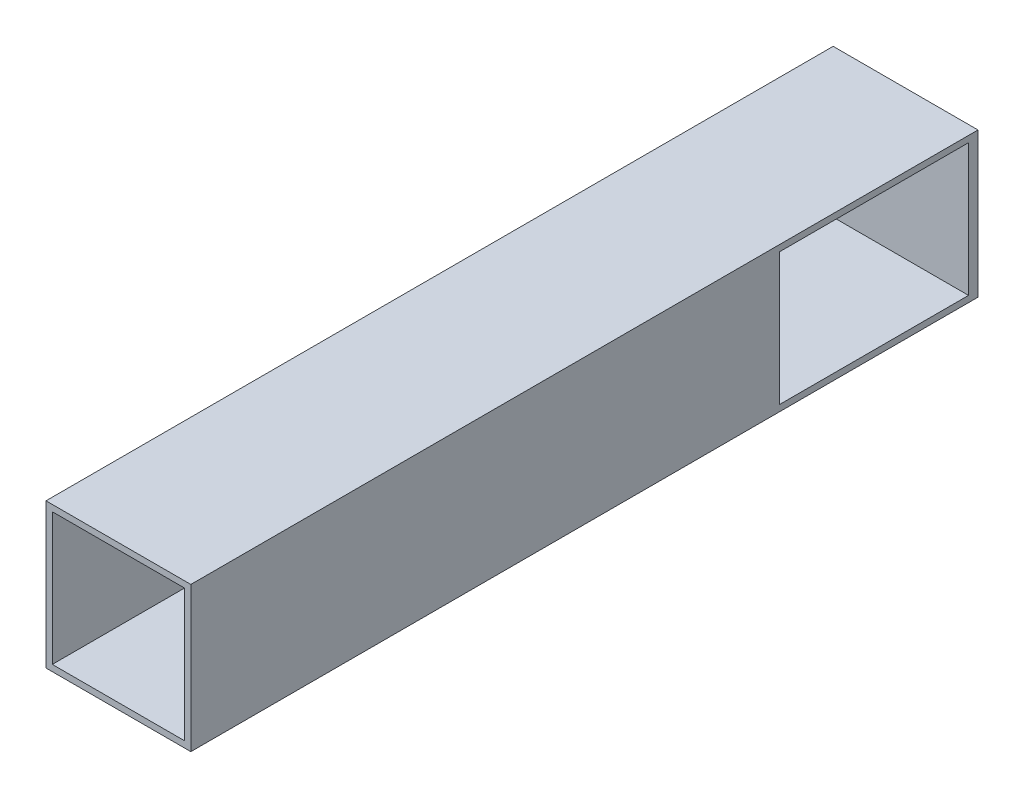
ISO-10303-21;
HEADER;
FILE_DESCRIPTION(('STEP AP214'),'2;1');
FILE_NAME('part.step','',(''),(''),'','','');
FILE_SCHEMA(('AUTOMOTIVE_DESIGN { 1 0 10303 214 1 1 1 1 }'));
ENDSEC;
DATA;
#1=APPLICATION_CONTEXT('core data for automotive mechanical design processes');
#2=APPLICATION_PROTOCOL_DEFINITION('international standard','automotive_design',2000,#1);
#3=PRODUCT_CONTEXT('',#1,'mechanical');
#4=PRODUCT('Part','Part','',(#3));
#5=PRODUCT_RELATED_PRODUCT_CATEGORY('part','',(#4));
#6=PRODUCT_DEFINITION_FORMATION('','',#4);
#7=PRODUCT_DEFINITION_CONTEXT('part definition',#1,'design');
#8=PRODUCT_DEFINITION('design','',#6,#7);
#9=PRODUCT_DEFINITION_SHAPE('','',#8);
#10=(LENGTH_UNIT() NAMED_UNIT(*) SI_UNIT(.MILLI.,.METRE.));
#11=(NAMED_UNIT(*) PLANE_ANGLE_UNIT() SI_UNIT($,.RADIAN.));
#12=(NAMED_UNIT(*) SI_UNIT($,.STERADIAN.) SOLID_ANGLE_UNIT());
#13=UNCERTAINTY_MEASURE_WITH_UNIT(LENGTH_MEASURE(1.E-05),#10,'distance_accuracy_value','');
#14=(GEOMETRIC_REPRESENTATION_CONTEXT(3) GLOBAL_UNCERTAINTY_ASSIGNED_CONTEXT((#13)) GLOBAL_UNIT_ASSIGNED_CONTEXT((#10,
#11,#12)) REPRESENTATION_CONTEXT('',''));
#15=CARTESIAN_POINT('',(0.,0.,0.));
#16=DIRECTION('',(0.,0.,1.));
#17=DIRECTION('',(1.,0.,0.));
#18=AXIS2_PLACEMENT_3D('',#15,#16,#17);
#19=CARTESIAN_POINT('',(13.6309958016777,15.2898102048579,635.));
#20=DIRECTION('',(1.,0.,0.));
#21=DIRECTION('',(0.,0.,-1.));
#22=AXIS2_PLACEMENT_3D('',#19,#20,#21);
#23=PLANE('',#22);
#24=DIRECTION('',(0.,-1.,0.));
#25=VECTOR('',#24,1.);
#26=CARTESIAN_POINT('',(13.6309958016777,15.2898102048579,0.));
#27=LINE('',#26,#25);
#28=CARTESIAN_POINT('',(13.6309958016777,15.2898102048579,0.));
#29=VERTEX_POINT('',#28);
#30=CARTESIAN_POINT('',(13.6309958016777,-101.550189795142,0.));
#31=VERTEX_POINT('',#30);
#32=EDGE_CURVE('E162',#29,#31,#27,.T.);
#33=ORIENTED_EDGE('',*,*,#32,.T.);
#34=DIRECTION('',(0.,0.,-1.));
#35=VECTOR('',#34,1.);
#36=CARTESIAN_POINT('',(13.6309958016777,-101.550189795142,635.));
#37=LINE('',#36,#35);
#38=CARTESIAN_POINT('',(13.6309958016777,-101.550189795142,635.));
#39=VERTEX_POINT('',#38);
#40=EDGE_CURVE('E11',#39,#31,#37,.T.);
#41=ORIENTED_EDGE('',*,*,#40,.F.);
#42=DIRECTION('',(0.,-1.,0.));
#43=VECTOR('',#42,1.);
#44=CARTESIAN_POINT('',(13.6309958016777,15.2898102048579,635.));
#45=LINE('',#44,#43);
#46=CARTESIAN_POINT('',(13.6309958016777,15.2898102048579,635.));
#47=VERTEX_POINT('',#46);
#48=EDGE_CURVE('E169',#47,#39,#45,.T.);
#49=ORIENTED_EDGE('',*,*,#48,.F.);
#50=DIRECTION('',(0.,0.,-1.));
#51=VECTOR('',#50,1.);
#52=CARTESIAN_POINT('',(13.6309958016777,15.2898102048579,635.));
#53=LINE('',#52,#51);
#54=EDGE_CURVE('E179',#47,#29,#53,.T.);
#55=ORIENTED_EDGE('',*,*,#54,.T.);
#56=EDGE_LOOP('',(#33,#41,#49,#55));
#57=FACE_BOUND('',#56,.T.);
#58=ADVANCED_FACE('F42',(#57),#23,.F.);
#59=CARTESIAN_POINT('',(13.6309958016777,-101.550189795142,635.));
#60=DIRECTION('',(0.,1.,0.));
#61=DIRECTION('',(-1.,0.,0.));
#62=AXIS2_PLACEMENT_3D('',#59,#60,#61);
#63=PLANE('',#62);
#64=DIRECTION('',(1.,0.,0.));
#65=VECTOR('',#64,1.);
#66=CARTESIAN_POINT('',(13.6309958016777,-101.550189795142,0.));
#67=LINE('',#66,#65);
#68=CARTESIAN_POINT('',(130.470995801678,-101.550189795142,0.));
#69=VERTEX_POINT('',#68);
#70=EDGE_CURVE('E182',#31,#69,#67,.T.);
#71=ORIENTED_EDGE('',*,*,#70,.T.);
#72=DIRECTION('',(0.,0.,-1.));
#73=VECTOR('',#72,1.);
#74=CARTESIAN_POINT('',(130.470995801678,-101.550189795142,635.));
#75=LINE('',#74,#73);
#76=CARTESIAN_POINT('',(130.470995801678,-101.550189795142,635.));
#77=VERTEX_POINT('',#76);
#78=EDGE_CURVE('E49',#77,#69,#75,.T.);
#79=ORIENTED_EDGE('',*,*,#78,.F.);
#80=DIRECTION('',(1.,0.,0.));
#81=VECTOR('',#80,1.);
#82=CARTESIAN_POINT('',(13.6309958016777,-101.550189795142,635.));
#83=LINE('',#82,#81);
#84=EDGE_CURVE('E172',#39,#77,#83,.T.);
#85=ORIENTED_EDGE('',*,*,#84,.F.);
#86=ORIENTED_EDGE('',*,*,#40,.T.);
#87=EDGE_LOOP('',(#71,#79,#85,#86));
#88=FACE_BOUND('',#87,.T.);
#89=ADVANCED_FACE('F210',(#88),#63,.F.);
#90=CARTESIAN_POINT('',(130.470995801678,15.2898102048579,635.));
#91=DIRECTION('',(-1.,0.,0.));
#92=DIRECTION('',(0.,0.,1.));
#93=AXIS2_PLACEMENT_3D('',#90,#91,#92);
#94=PLANE('',#93);
#95=DIRECTION('',(0.,0.,1.));
#96=VECTOR('',#95,1.);
#97=CARTESIAN_POINT('',(130.470995801678,10.2098102048579,160.02));
#98=LINE('',#97,#96);
#99=CARTESIAN_POINT('',(130.470995801678,10.2098102048579,7.62000000000007));
#100=VERTEX_POINT('',#99);
#101=CARTESIAN_POINT('',(130.470995801678,10.2098102048579,160.02));
#102=VERTEX_POINT('',#101);
#103=EDGE_CURVE('E127',#100,#102,#98,.T.);
#104=ORIENTED_EDGE('',*,*,#103,.F.);
#105=DIRECTION('',(0.,1.,0.));
#106=VECTOR('',#105,1.);
#107=CARTESIAN_POINT('',(130.470995801678,-96.4701897951421,7.62));
#108=LINE('',#107,#106);
#109=CARTESIAN_POINT('',(130.470995801678,-96.4701897951421,7.62));
#110=VERTEX_POINT('',#109);
#111=EDGE_CURVE('E131',#110,#100,#108,.T.);
#112=ORIENTED_EDGE('',*,*,#111,.F.);
#113=DIRECTION('',(0.,0.,-1.));
#114=VECTOR('',#113,1.);
#115=CARTESIAN_POINT('',(130.470995801678,-96.4701897951421,7.62));
#116=LINE('',#115,#114);
#117=CARTESIAN_POINT('',(130.470995801678,-96.4701897951421,160.02));
#118=VERTEX_POINT('',#117);
#119=EDGE_CURVE('E124',#118,#110,#116,.T.);
#120=ORIENTED_EDGE('',*,*,#119,.F.);
#121=DIRECTION('',(0.,-1.,0.));
#122=VECTOR('',#121,1.);
#123=CARTESIAN_POINT('',(130.470995801678,-96.4701897951421,160.02));
#124=LINE('',#123,#122);
#125=EDGE_CURVE('E118',#102,#118,#124,.T.);
#126=ORIENTED_EDGE('',*,*,#125,.F.);
#127=EDGE_LOOP('',(#104,#112,#120,#126));
#128=FACE_BOUND('',#127,.T.);
#129=DIRECTION('',(0.,1.,0.));
#130=VECTOR('',#129,1.);
#131=CARTESIAN_POINT('',(130.470995801678,15.2898102048579,0.));
#132=LINE('',#131,#130);
#133=CARTESIAN_POINT('',(130.470995801678,15.2898102048579,0.));
#134=VERTEX_POINT('',#133);
#135=EDGE_CURVE('E184',#69,#134,#132,.T.);
#136=ORIENTED_EDGE('',*,*,#135,.T.);
#137=DIRECTION('',(0.,0.,-1.));
#138=VECTOR('',#137,1.);
#139=CARTESIAN_POINT('',(130.470995801678,15.2898102048579,635.));
#140=LINE('',#139,#138);
#141=CARTESIAN_POINT('',(130.470995801678,15.2898102048579,635.));
#142=VERTEX_POINT('',#141);
#143=EDGE_CURVE('E189',#142,#134,#140,.T.);
#144=ORIENTED_EDGE('',*,*,#143,.F.);
#145=DIRECTION('',(0.,1.,0.));
#146=VECTOR('',#145,1.);
#147=CARTESIAN_POINT('',(130.470995801678,15.2898102048579,635.));
#148=LINE('',#147,#146);
#149=EDGE_CURVE('E175',#77,#142,#148,.T.);
#150=ORIENTED_EDGE('',*,*,#149,.F.);
#151=ORIENTED_EDGE('',*,*,#78,.T.);
#152=EDGE_LOOP('',(#136,#144,#150,#151));
#153=FACE_BOUND('',#152,.T.);
#154=ADVANCED_FACE('F133',(#128,#153),#94,.F.);
#155=CARTESIAN_POINT('',(13.6309958016777,15.2898102048579,635.));
#156=DIRECTION('',(0.,-1.,0.));
#157=DIRECTION('',(0.,0.,-1.));
#158=AXIS2_PLACEMENT_3D('',#155,#156,#157);
#159=PLANE('',#158);
#160=DIRECTION('',(-1.,0.,0.));
#161=VECTOR('',#160,1.);
#162=CARTESIAN_POINT('',(13.6309958016777,15.2898102048579,0.));
#163=LINE('',#162,#161);
#164=EDGE_CURVE('E173',#134,#29,#163,.T.);
#165=ORIENTED_EDGE('',*,*,#164,.T.);
#166=ORIENTED_EDGE('',*,*,#54,.F.);
#167=DIRECTION('',(-1.,0.,0.));
#168=VECTOR('',#167,1.);
#169=CARTESIAN_POINT('',(13.6309958016777,15.2898102048579,635.));
#170=LINE('',#169,#168);
#171=EDGE_CURVE('E177',#142,#47,#170,.T.);
#172=ORIENTED_EDGE('',*,*,#171,.F.);
#173=ORIENTED_EDGE('',*,*,#143,.T.);
#174=EDGE_LOOP('',(#165,#166,#172,#173));
#175=FACE_BOUND('',#174,.T.);
#176=ADVANCED_FACE('F203',(#175),#159,.F.);
#177=CARTESIAN_POINT('',(0.,0.,635.));
#178=DIRECTION('',(0.,0.,1.));
#179=DIRECTION('',(1.,0.,0.));
#180=AXIS2_PLACEMENT_3D('',#177,#178,#179);
#181=PLANE('',#180);
#182=DIRECTION('',(0.,-1.,0.));
#183=VECTOR('',#182,1.);
#184=CARTESIAN_POINT('',(18.7109958016777,-96.4701897951421,635.));
#185=LINE('',#184,#183);
#186=CARTESIAN_POINT('',(18.7109958016777,10.2098102048579,635.));
#187=VERTEX_POINT('',#186);
#188=CARTESIAN_POINT('',(18.7109958016777,-96.4701897951421,635.));
#189=VERTEX_POINT('',#188);
#190=EDGE_CURVE('E142',#187,#189,#185,.T.);
#191=ORIENTED_EDGE('',*,*,#190,.F.);
#192=DIRECTION('',(-1.,0.,0.));
#193=VECTOR('',#192,1.);
#194=CARTESIAN_POINT('',(18.7109958016777,10.2098102048579,635.));
#195=LINE('',#194,#193);
#196=CARTESIAN_POINT('',(125.390995801678,10.2098102048579,635.));
#197=VERTEX_POINT('',#196);
#198=EDGE_CURVE('E147',#197,#187,#195,.T.);
#199=ORIENTED_EDGE('',*,*,#198,.F.);
#200=DIRECTION('',(0.,1.,0.));
#201=VECTOR('',#200,1.);
#202=CARTESIAN_POINT('',(125.390995801678,-96.4701897951421,635.));
#203=LINE('',#202,#201);
#204=CARTESIAN_POINT('',(125.390995801678,-96.4701897951421,635.));
#205=VERTEX_POINT('',#204);
#206=EDGE_CURVE('E155',#205,#197,#203,.T.);
#207=ORIENTED_EDGE('',*,*,#206,.F.);
#208=DIRECTION('',(1.,0.,0.));
#209=VECTOR('',#208,1.);
#210=CARTESIAN_POINT('',(18.7109958016777,-96.4701897951421,635.));
#211=LINE('',#210,#209);
#212=EDGE_CURVE('E152',#189,#205,#211,.T.);
#213=ORIENTED_EDGE('',*,*,#212,.F.);
#214=EDGE_LOOP('',(#191,#199,#207,#213));
#215=FACE_BOUND('',#214,.T.);
#216=ORIENTED_EDGE('',*,*,#48,.T.);
#217=ORIENTED_EDGE('',*,*,#84,.T.);
#218=ORIENTED_EDGE('',*,*,#149,.T.);
#219=ORIENTED_EDGE('',*,*,#171,.T.);
#220=EDGE_LOOP('',(#216,#217,#218,#219));
#221=FACE_BOUND('',#220,.T.);
#222=ADVANCED_FACE('F209',(#215,#221),#181,.T.);
#223=CARTESIAN_POINT('',(0.,0.,0.));
#224=DIRECTION('',(0.,0.,1.));
#225=DIRECTION('',(1.,0.,0.));
#226=AXIS2_PLACEMENT_3D('',#223,#224,#225);
#227=PLANE('',#226);
#228=ORIENTED_EDGE('',*,*,#32,.F.);
#229=ORIENTED_EDGE('',*,*,#164,.F.);
#230=ORIENTED_EDGE('',*,*,#135,.F.);
#231=ORIENTED_EDGE('',*,*,#70,.F.);
#232=EDGE_LOOP('',(#228,#229,#230,#231));
#233=FACE_BOUND('',#232,.T.);
#234=ADVANCED_FACE('F200',(#233),#227,.F.);
#235=CARTESIAN_POINT('',(18.7109958016777,-96.4701897951421,7.62000000000007));
#236=DIRECTION('',(-1.,0.,0.));
#237=DIRECTION('',(0.,0.,1.));
#238=AXIS2_PLACEMENT_3D('',#235,#236,#237);
#239=PLANE('',#238);
#240=ORIENTED_EDGE('',*,*,#190,.T.);
#241=DIRECTION('',(0.,0.,1.));
#242=VECTOR('',#241,1.);
#243=CARTESIAN_POINT('',(18.7109958016777,-96.4701897951421,7.62000000000007));
#244=LINE('',#243,#242);
#245=CARTESIAN_POINT('',(18.7109958016777,-96.4701897951421,7.62000000000007));
#246=VERTEX_POINT('',#245);
#247=EDGE_CURVE('E150',#246,#189,#244,.T.);
#248=ORIENTED_EDGE('',*,*,#247,.F.);
#249=DIRECTION('',(0.,-1.,0.));
#250=VECTOR('',#249,1.);
#251=CARTESIAN_POINT('',(18.7109958016777,-96.4701897951421,7.62000000000007));
#252=LINE('',#251,#250);
#253=CARTESIAN_POINT('',(18.7109958016777,10.2098102048579,7.62000000000007));
#254=VERTEX_POINT('',#253);
#255=EDGE_CURVE('E143',#254,#246,#252,.T.);
#256=ORIENTED_EDGE('',*,*,#255,.F.);
#257=DIRECTION('',(0.,0.,1.));
#258=VECTOR('',#257,1.);
#259=CARTESIAN_POINT('',(18.7109958016777,10.2098102048579,7.62000000000007));
#260=LINE('',#259,#258);
#261=EDGE_CURVE('E160',#254,#187,#260,.T.);
#262=ORIENTED_EDGE('',*,*,#261,.T.);
#263=EDGE_LOOP('',(#240,#248,#256,#262));
#264=FACE_BOUND('',#263,.T.);
#265=ADVANCED_FACE('F222',(#264),#239,.F.);
#266=CARTESIAN_POINT('',(18.7109958016777,10.2098102048579,7.62000000000007));
#267=DIRECTION('',(0.,1.,0.));
#268=DIRECTION('',(-1.,0.,0.));
#269=AXIS2_PLACEMENT_3D('',#266,#267,#268);
#270=PLANE('',#269);
#271=DIRECTION('',(1.,0.,0.));
#272=VECTOR('',#271,1.);
#273=CARTESIAN_POINT('',(122.850995801678,10.2098102048579,160.02));
#274=LINE('',#273,#272);
#275=CARTESIAN_POINT('',(125.390995801678,10.2098102048579,160.02));
#276=VERTEX_POINT('',#275);
#277=EDGE_CURVE('E62',#276,#102,#274,.T.);
#278=ORIENTED_EDGE('',*,*,#277,.F.);
#279=DIRECTION('',(0.,0.,1.));
#280=VECTOR('',#279,1.);
#281=CARTESIAN_POINT('',(125.390995801678,10.2098102048579,7.62000000000007));
#282=LINE('',#281,#280);
#283=EDGE_CURVE('E163',#276,#197,#282,.T.);
#284=ORIENTED_EDGE('',*,*,#283,.T.);
#285=ORIENTED_EDGE('',*,*,#198,.T.);
#286=ORIENTED_EDGE('',*,*,#261,.F.);
#287=DIRECTION('',(-1.,0.,0.));
#288=VECTOR('',#287,1.);
#289=CARTESIAN_POINT('',(18.7109958016777,10.2098102048579,7.62000000000007));
#290=LINE('',#289,#288);
#291=EDGE_CURVE('E56',#100,#254,#290,.T.);
#292=ORIENTED_EDGE('',*,*,#291,.F.);
#293=ORIENTED_EDGE('',*,*,#103,.T.);
#294=EDGE_LOOP('',(#278,#284,#285,#286,#292,#293));
#295=FACE_BOUND('',#294,.T.);
#296=ADVANCED_FACE('F128',(#295),#270,.F.);
#297=CARTESIAN_POINT('',(125.390995801678,-96.4701897951421,7.62000000000007));
#298=DIRECTION('',(1.,0.,0.));
#299=DIRECTION('',(0.,0.,-1.));
#300=AXIS2_PLACEMENT_3D('',#297,#298,#299);
#301=PLANE('',#300);
#302=ORIENTED_EDGE('',*,*,#283,.F.);
#303=DIRECTION('',(0.,-1.,0.));
#304=VECTOR('',#303,1.);
#305=CARTESIAN_POINT('',(125.390995801678,-96.4701897951421,160.02));
#306=LINE('',#305,#304);
#307=CARTESIAN_POINT('',(125.390995801678,-96.4701897951421,160.02));
#308=VERTEX_POINT('',#307);
#309=EDGE_CURVE('E121',#276,#308,#306,.T.);
#310=ORIENTED_EDGE('',*,*,#309,.T.);
#311=DIRECTION('',(0.,0.,1.));
#312=VECTOR('',#311,1.);
#313=CARTESIAN_POINT('',(125.390995801678,-96.4701897951421,7.62000000000007));
#314=LINE('',#313,#312);
#315=EDGE_CURVE('E165',#308,#205,#314,.T.);
#316=ORIENTED_EDGE('',*,*,#315,.T.);
#317=ORIENTED_EDGE('',*,*,#206,.T.);
#318=EDGE_LOOP('',(#302,#310,#316,#317));
#319=FACE_BOUND('',#318,.T.);
#320=ADVANCED_FACE('F233',(#319),#301,.F.);
#321=CARTESIAN_POINT('',(18.7109958016777,-96.4701897951421,7.62000000000007));
#322=DIRECTION('',(0.,-1.,0.));
#323=DIRECTION('',(0.,0.,-1.));
#324=AXIS2_PLACEMENT_3D('',#321,#322,#323);
#325=PLANE('',#324);
#326=ORIENTED_EDGE('',*,*,#315,.F.);
#327=DIRECTION('',(1.,0.,0.));
#328=VECTOR('',#327,1.);
#329=CARTESIAN_POINT('',(122.850995801678,-96.4701897951421,160.02));
#330=LINE('',#329,#328);
#331=EDGE_CURVE('E123',#308,#118,#330,.T.);
#332=ORIENTED_EDGE('',*,*,#331,.T.);
#333=ORIENTED_EDGE('',*,*,#119,.T.);
#334=DIRECTION('',(1.,0.,0.));
#335=VECTOR('',#334,1.);
#336=CARTESIAN_POINT('',(18.7109958016777,-96.4701897951421,7.62000000000007));
#337=LINE('',#336,#335);
#338=EDGE_CURVE('E146',#246,#110,#337,.T.);
#339=ORIENTED_EDGE('',*,*,#338,.F.);
#340=ORIENTED_EDGE('',*,*,#247,.T.);
#341=ORIENTED_EDGE('',*,*,#212,.T.);
#342=EDGE_LOOP('',(#326,#332,#333,#339,#340,#341));
#343=FACE_BOUND('',#342,.T.);
#344=ADVANCED_FACE('F229',(#343),#325,.F.);
#345=CARTESIAN_POINT('',(0.,0.,7.62000000000007));
#346=DIRECTION('',(0.,0.,-1.));
#347=DIRECTION('',(-1.,0.,0.));
#348=AXIS2_PLACEMENT_3D('',#345,#346,#347);
#349=PLANE('',#348);
#350=ORIENTED_EDGE('',*,*,#338,.T.);
#351=ORIENTED_EDGE('',*,*,#111,.T.);
#352=ORIENTED_EDGE('',*,*,#291,.T.);
#353=ORIENTED_EDGE('',*,*,#255,.T.);
#354=EDGE_LOOP('',(#350,#351,#352,#353));
#355=FACE_BOUND('',#354,.T.);
#356=ADVANCED_FACE('F232',(#355),#349,.F.);
#357=CARTESIAN_POINT('',(122.850995801678,-96.4701897951421,160.02));
#358=DIRECTION('',(0.,0.,1.));
#359=DIRECTION('',(1.,0.,0.));
#360=AXIS2_PLACEMENT_3D('',#357,#358,#359);
#361=PLANE('',#360);
#362=ORIENTED_EDGE('',*,*,#277,.T.);
#363=ORIENTED_EDGE('',*,*,#125,.T.);
#364=ORIENTED_EDGE('',*,*,#331,.F.);
#365=ORIENTED_EDGE('',*,*,#309,.F.);
#366=EDGE_LOOP('',(#362,#363,#364,#365));
#367=FACE_BOUND('',#366,.T.);
#368=ADVANCED_FACE('F116',(#367),#361,.F.);
#369=CLOSED_SHELL('',(#58,#89,#154,#176,#222,#234,#265,#296,#320,#344,#356,#368));
#370=MANIFOLD_SOLID_BREP('B2',#369);
#371=ADVANCED_BREP_SHAPE_REPRESENTATION('',(#18,#370),#14);
#372=SHAPE_DEFINITION_REPRESENTATION(#9,#371);
ENDSEC;
END-ISO-10303-21;
